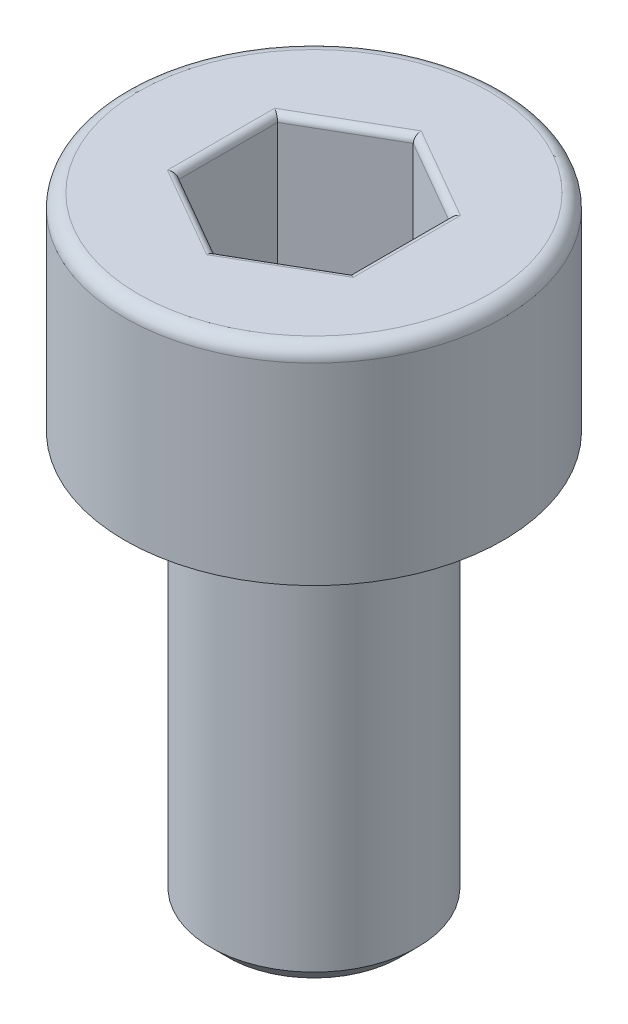
ISO-10303-21;
HEADER;
FILE_DESCRIPTION(('STEP AP214'),'2;1');
FILE_NAME('part.step','',(''),(''),'','','');
FILE_SCHEMA(('AUTOMOTIVE_DESIGN { 1 0 10303 214 1 1 1 1 }'));
ENDSEC;
DATA;
#1=APPLICATION_CONTEXT('core data for automotive mechanical design processes');
#2=APPLICATION_PROTOCOL_DEFINITION('international standard','automotive_design',2000,#1);
#3=PRODUCT_CONTEXT('',#1,'mechanical');
#4=PRODUCT('Part','Part','',(#3));
#5=PRODUCT_RELATED_PRODUCT_CATEGORY('part','',(#4));
#6=PRODUCT_DEFINITION_FORMATION('','',#4);
#7=PRODUCT_DEFINITION_CONTEXT('part definition',#1,'design');
#8=PRODUCT_DEFINITION('design','',#6,#7);
#9=PRODUCT_DEFINITION_SHAPE('','',#8);
#10=(LENGTH_UNIT() NAMED_UNIT(*) SI_UNIT(.MILLI.,.METRE.));
#11=(NAMED_UNIT(*) PLANE_ANGLE_UNIT() SI_UNIT($,.RADIAN.));
#12=(NAMED_UNIT(*) SI_UNIT($,.STERADIAN.) SOLID_ANGLE_UNIT());
#13=UNCERTAINTY_MEASURE_WITH_UNIT(LENGTH_MEASURE(1.E-05),#10,'distance_accuracy_value','');
#14=(GEOMETRIC_REPRESENTATION_CONTEXT(3) GLOBAL_UNCERTAINTY_ASSIGNED_CONTEXT((#13)) GLOBAL_UNIT_ASSIGNED_CONTEXT((#10,
#11,#12)) REPRESENTATION_CONTEXT('',''));
#15=CARTESIAN_POINT('',(0.,0.,0.));
#16=DIRECTION('',(0.,0.,1.));
#17=DIRECTION('',(1.,0.,0.));
#18=AXIS2_PLACEMENT_3D('',#15,#16,#17);
#19=CARTESIAN_POINT('',(0.,-9.,0.));
#20=DIRECTION('',(0.,-1.,0.));
#21=DIRECTION('',(0.,0.,-1.));
#22=AXIS2_PLACEMENT_3D('',#19,#20,#21);
#23=PLANE('',#22);
#24=CARTESIAN_POINT('',(0.,-9.,0.));
#25=DIRECTION('',(0.,-1.,0.));
#26=DIRECTION('',(0.,0.,-1.));
#27=AXIS2_PLACEMENT_3D('',#24,#25,#26);
#28=CIRCLE('',#27,1.25);
#29=CARTESIAN_POINT('',(0.,-9.,-1.25));
#30=VERTEX_POINT('',#29);
#31=EDGE_CURVE('E261',#30,#30,#28,.T.);
#32=ORIENTED_EDGE('',*,*,#31,.T.);
#33=EDGE_LOOP('',(#32));
#34=FACE_BOUND('',#33,.T.);
#35=ADVANCED_FACE('F33',(#34),#23,.T.);
#36=CARTESIAN_POINT('',(0.,0.,0.));
#37=DIRECTION('',(0.,1.,0.));
#38=DIRECTION('',(0.,0.,1.));
#39=AXIS2_PLACEMENT_3D('',#36,#37,#38);
#40=CYLINDRICAL_SURFACE('',#39,1.5);
#41=CARTESIAN_POINT('',(0.,-3.25,0.));
#42=DIRECTION('',(0.,-1.,0.));
#43=DIRECTION('',(0.,0.,-1.));
#44=AXIS2_PLACEMENT_3D('',#41,#42,#43);
#45=CIRCLE('',#44,1.5);
#46=CARTESIAN_POINT('',(0.,-3.25,-1.5));
#47=VERTEX_POINT('',#46);
#48=EDGE_CURVE('E258',#47,#47,#45,.T.);
#49=ORIENTED_EDGE('',*,*,#48,.T.);
#50=EDGE_LOOP('',(#49));
#51=FACE_BOUND('',#50,.T.);
#52=CARTESIAN_POINT('',(0.,-8.75,0.));
#53=DIRECTION('',(0.,-1.,0.));
#54=DIRECTION('',(0.,0.,-1.));
#55=AXIS2_PLACEMENT_3D('',#52,#53,#54);
#56=CIRCLE('',#55,1.5);
#57=CARTESIAN_POINT('',(0.,-8.75,-1.5));
#58=VERTEX_POINT('',#57);
#59=EDGE_CURVE('E255',#58,#58,#56,.F.);
#60=ORIENTED_EDGE('',*,*,#59,.T.);
#61=EDGE_LOOP('',(#60));
#62=FACE_BOUND('',#61,.T.);
#63=ADVANCED_FACE('F287',(#51,#62),#40,.T.);
#64=CARTESIAN_POINT('',(-1.5,-3.,0.));
#65=DIRECTION('',(0.,-1.,0.));
#66=DIRECTION('',(0.,0.,-1.));
#67=AXIS2_PLACEMENT_3D('',#64,#65,#66);
#68=PLANE('',#67);
#69=CARTESIAN_POINT('',(0.,-3.,0.));
#70=DIRECTION('',(0.,-1.,0.));
#71=DIRECTION('',(0.,0.,-1.));
#72=AXIS2_PLACEMENT_3D('',#69,#70,#71);
#73=CIRCLE('',#72,1.75);
#74=CARTESIAN_POINT('',(0.,-3.,-1.75));
#75=VERTEX_POINT('',#74);
#76=EDGE_CURVE('E252',#75,#75,#73,.F.);
#77=ORIENTED_EDGE('',*,*,#76,.T.);
#78=EDGE_LOOP('',(#77));
#79=FACE_BOUND('',#78,.T.);
#80=CARTESIAN_POINT('',(0.,-3.,0.));
#81=DIRECTION('',(0.,1.,0.));
#82=DIRECTION('',(0.,0.,1.));
#83=AXIS2_PLACEMENT_3D('',#80,#81,#82);
#84=CIRCLE('',#83,2.75);
#85=CARTESIAN_POINT('',(0.,-3.,2.75));
#86=VERTEX_POINT('',#85);
#87=EDGE_CURVE('E249',#86,#86,#84,.T.);
#88=ORIENTED_EDGE('',*,*,#87,.F.);
#89=EDGE_LOOP('',(#88));
#90=FACE_BOUND('',#89,.T.);
#91=ADVANCED_FACE('F293',(#79,#90),#68,.T.);
#92=CARTESIAN_POINT('',(0.,0.,0.));
#93=DIRECTION('',(0.,1.,0.));
#94=DIRECTION('',(0.,0.,1.));
#95=AXIS2_PLACEMENT_3D('',#92,#93,#94);
#96=CYLINDRICAL_SURFACE('',#95,2.75);
#97=CARTESIAN_POINT('',(0.,-0.2,0.));
#98=DIRECTION('',(0.,1.,0.));
#99=DIRECTION('',(0.,0.,1.));
#100=AXIS2_PLACEMENT_3D('',#97,#98,#99);
#101=CIRCLE('',#100,2.75);
#102=CARTESIAN_POINT('',(0.,-0.2,2.75));
#103=VERTEX_POINT('',#102);
#104=EDGE_CURVE('E159',#103,#103,#101,.F.);
#105=ORIENTED_EDGE('',*,*,#104,.T.);
#106=EDGE_LOOP('',(#105));
#107=FACE_BOUND('',#106,.T.);
#108=ORIENTED_EDGE('',*,*,#87,.T.);
#109=EDGE_LOOP('',(#108));
#110=FACE_BOUND('',#109,.T.);
#111=ADVANCED_FACE('F303',(#107,#110),#96,.T.);
#112=CARTESIAN_POINT('',(-2.75,0.,0.));
#113=DIRECTION('',(0.,1.,0.));
#114=DIRECTION('',(0.,0.,1.));
#115=AXIS2_PLACEMENT_3D('',#112,#113,#114);
#116=PLANE('',#115);
#117=DIRECTION('',(0.,0.,1.));
#118=VECTOR('',#117,1.);
#119=CARTESIAN_POINT('',(-1.35,0.,-0.721687836487033));
#120=LINE('',#119,#118);
#121=CARTESIAN_POINT('',(-1.35,0.,0.779422863405995));
#122=VERTEX_POINT('',#121);
#123=CARTESIAN_POINT('',(-1.35,0.,-0.779422863405995));
#124=VERTEX_POINT('',#123);
#125=EDGE_CURVE('E175',#122,#124,#120,.F.);
#126=ORIENTED_EDGE('',*,*,#125,.T.);
#127=DIRECTION('',(-0.866025403784439,0.,0.5));
#128=VECTOR('',#127,1.);
#129=CARTESIAN_POINT('',(-0.0500000000000002,0.,-1.52997821335251));
#130=LINE('',#129,#128);
#131=CARTESIAN_POINT('',(0.,0.,-1.55884572681199));
#132=VERTEX_POINT('',#131);
#133=EDGE_CURVE('E134',#124,#132,#130,.F.);
#134=ORIENTED_EDGE('',*,*,#133,.T.);
#135=DIRECTION('',(-0.866025403784439,0.,-0.5));
#136=VECTOR('',#135,1.);
#137=CARTESIAN_POINT('',(1.3,0.,-0.808290376865477));
#138=LINE('',#137,#136);
#139=CARTESIAN_POINT('',(1.35,0.,-0.779422863405995));
#140=VERTEX_POINT('',#139);
#141=EDGE_CURVE('E161',#132,#140,#138,.F.);
#142=ORIENTED_EDGE('',*,*,#141,.T.);
#143=DIRECTION('',(0.,0.,-1.));
#144=VECTOR('',#143,1.);
#145=CARTESIAN_POINT('',(1.35,0.,0.721687836487034));
#146=LINE('',#145,#144);
#147=CARTESIAN_POINT('',(1.35,0.,0.779422863405996));
#148=VERTEX_POINT('',#147);
#149=EDGE_CURVE('E169',#140,#148,#146,.F.);
#150=ORIENTED_EDGE('',*,*,#149,.T.);
#151=DIRECTION('',(0.866025403784439,0.,-0.5));
#152=VECTOR('',#151,1.);
#153=CARTESIAN_POINT('',(0.05,0.,1.52997821335251));
#154=LINE('',#153,#152);
#155=CARTESIAN_POINT('',(0.,0.,1.55884572681199));
#156=VERTEX_POINT('',#155);
#157=EDGE_CURVE('E171',#148,#156,#154,.F.);
#158=ORIENTED_EDGE('',*,*,#157,.T.);
#159=DIRECTION('',(0.866025403784438,0.,0.5));
#160=VECTOR('',#159,1.);
#161=CARTESIAN_POINT('',(-1.3,0.,0.808290376865476));
#162=LINE('',#161,#160);
#163=EDGE_CURVE('E173',#156,#122,#162,.F.);
#164=ORIENTED_EDGE('',*,*,#163,.T.);
#165=EDGE_LOOP('',(#126,#134,#142,#150,#158,#164));
#166=FACE_BOUND('',#165,.T.);
#167=CARTESIAN_POINT('',(0.,0.,0.));
#168=DIRECTION('',(0.,1.,0.));
#169=DIRECTION('',(0.,0.,1.));
#170=AXIS2_PLACEMENT_3D('',#167,#168,#169);
#171=CIRCLE('',#170,2.55);
#172=CARTESIAN_POINT('',(0.,0.,2.55));
#173=VERTEX_POINT('',#172);
#174=EDGE_CURVE('E164',#173,#173,#171,.T.);
#175=ORIENTED_EDGE('',*,*,#174,.T.);
#176=EDGE_LOOP('',(#175));
#177=FACE_BOUND('',#176,.T.);
#178=ADVANCED_FACE('F266',(#166,#177),#116,.T.);
#179=CARTESIAN_POINT('',(0.,-3.,0.));
#180=DIRECTION('',(0.,1.,0.));
#181=DIRECTION('',(0.,0.,1.));
#182=AXIS2_PLACEMENT_3D('',#179,#180,#181);
#183=CONICAL_SURFACE('',#182,1.75,0.785398163397453);
#184=ORIENTED_EDGE('',*,*,#48,.F.);
#185=EDGE_LOOP('',(#184));
#186=FACE_BOUND('',#185,.T.);
#187=ORIENTED_EDGE('',*,*,#76,.F.);
#188=EDGE_LOOP('',(#187));
#189=FACE_BOUND('',#188,.T.);
#190=ADVANCED_FACE('F281',(#186,#189),#183,.T.);
#191=CARTESIAN_POINT('',(0.,-8.75,0.));
#192=DIRECTION('',(0.,1.,0.));
#193=DIRECTION('',(0.,0.,1.));
#194=AXIS2_PLACEMENT_3D('',#191,#192,#193);
#195=CONICAL_SURFACE('',#194,1.5,0.785398163397454);
#196=ORIENTED_EDGE('',*,*,#31,.F.);
#197=EDGE_LOOP('',(#196));
#198=FACE_BOUND('',#197,.T.);
#199=ORIENTED_EDGE('',*,*,#59,.F.);
#200=EDGE_LOOP('',(#199));
#201=FACE_BOUND('',#200,.T.);
#202=ADVANCED_FACE('F271',(#198,#201),#195,.T.);
#203=CARTESIAN_POINT('',(0.,-0.2,0.));
#204=DIRECTION('',(0.,1.,0.));
#205=DIRECTION('',(0.,0.,1.));
#206=AXIS2_PLACEMENT_3D('',#203,#204,#205);
#207=TOROIDAL_SURFACE('',#206,2.55,0.2);
#208=ORIENTED_EDGE('',*,*,#104,.F.);
#209=EDGE_LOOP('',(#208));
#210=FACE_BOUND('',#209,.T.);
#211=ORIENTED_EDGE('',*,*,#174,.F.);
#212=EDGE_LOOP('',(#211));
#213=FACE_BOUND('',#212,.T.);
#214=ADVANCED_FACE('F268',(#210,#213),#207,.T.);
#215=CARTESIAN_POINT('',(1.25,-2.,-0.721687836487033));
#216=DIRECTION('',(0.5,0.,-0.866025403784439));
#217=DIRECTION('',(-0.866025403784439,0.,-0.5));
#218=AXIS2_PLACEMENT_3D('',#215,#216,#217);
#219=PLANE('',#218);
#220=DIRECTION('',(0.,1.,0.));
#221=VECTOR('',#220,1.);
#222=CARTESIAN_POINT('',(1.25,-2.,-0.721687836487033));
#223=LINE('',#222,#221);
#224=CARTESIAN_POINT('',(1.25,-1.9,-0.721687836487033));
#225=VERTEX_POINT('',#224);
#226=CARTESIAN_POINT('',(1.25,-0.1,-0.721687836487033));
#227=VERTEX_POINT('',#226);
#228=EDGE_CURVE('E243',#225,#227,#223,.T.);
#229=ORIENTED_EDGE('',*,*,#228,.T.);
#230=DIRECTION('',(-0.866025403784439,0.,-0.5));
#231=VECTOR('',#230,1.);
#232=CARTESIAN_POINT('',(0.,-0.1,-1.44337567297406));
#233=LINE('',#232,#231);
#234=CARTESIAN_POINT('',(0.,-0.1,-1.44337567297406));
#235=VERTEX_POINT('',#234);
#236=EDGE_CURVE('E195',#227,#235,#233,.T.);
#237=ORIENTED_EDGE('',*,*,#236,.T.);
#238=DIRECTION('',(0.,1.,0.));
#239=VECTOR('',#238,1.);
#240=CARTESIAN_POINT('',(0.,-2.,-1.44337567297406));
#241=LINE('',#240,#239);
#242=CARTESIAN_POINT('',(0.,-1.9,-1.44337567297406));
#243=VERTEX_POINT('',#242);
#244=EDGE_CURVE('E145',#243,#235,#241,.T.);
#245=ORIENTED_EDGE('',*,*,#244,.F.);
#246=DIRECTION('',(-0.866025403784439,0.,-0.5));
#247=VECTOR('',#246,1.);
#248=CARTESIAN_POINT('',(1.25,-1.9,-0.721687836487033));
#249=LINE('',#248,#247);
#250=EDGE_CURVE('E193',#243,#225,#249,.F.);
#251=ORIENTED_EDGE('',*,*,#250,.T.);
#252=EDGE_LOOP('',(#229,#237,#245,#251));
#253=FACE_BOUND('',#252,.T.);
#254=ADVANCED_FACE('F270',(#253),#219,.F.);
#255=CARTESIAN_POINT('',(1.25,-2.,0.721687836487034));
#256=DIRECTION('',(1.,0.,0.));
#257=DIRECTION('',(0.,0.,-1.));
#258=AXIS2_PLACEMENT_3D('',#255,#256,#257);
#259=PLANE('',#258);
#260=DIRECTION('',(0.,1.,0.));
#261=VECTOR('',#260,1.);
#262=CARTESIAN_POINT('',(1.25,-2.,0.721687836487034));
#263=LINE('',#262,#261);
#264=CARTESIAN_POINT('',(1.25,-1.9,0.721687836487034));
#265=VERTEX_POINT('',#264);
#266=CARTESIAN_POINT('',(1.25,-0.1,0.721687836487034));
#267=VERTEX_POINT('',#266);
#268=EDGE_CURVE('E240',#265,#267,#263,.T.);
#269=ORIENTED_EDGE('',*,*,#268,.T.);
#270=DIRECTION('',(0.,0.,-1.));
#271=VECTOR('',#270,1.);
#272=CARTESIAN_POINT('',(1.25,-0.1,-0.721687836487033));
#273=LINE('',#272,#271);
#274=EDGE_CURVE('E191',#267,#227,#273,.T.);
#275=ORIENTED_EDGE('',*,*,#274,.T.);
#276=ORIENTED_EDGE('',*,*,#228,.F.);
#277=DIRECTION('',(0.,0.,-1.));
#278=VECTOR('',#277,1.);
#279=CARTESIAN_POINT('',(1.25,-1.9,0.721687836487034));
#280=LINE('',#279,#278);
#281=EDGE_CURVE('E188',#225,#265,#280,.F.);
#282=ORIENTED_EDGE('',*,*,#281,.T.);
#283=EDGE_LOOP('',(#269,#275,#276,#282));
#284=FACE_BOUND('',#283,.T.);
#285=ADVANCED_FACE('F278',(#284),#259,.F.);
#286=CARTESIAN_POINT('',(0.,-2.,1.44337567297407));
#287=DIRECTION('',(0.5,0.,0.866025403784439));
#288=DIRECTION('',(0.866025403784439,0.,-0.5));
#289=AXIS2_PLACEMENT_3D('',#286,#287,#288);
#290=PLANE('',#289);
#291=DIRECTION('',(0.,1.,0.));
#292=VECTOR('',#291,1.);
#293=CARTESIAN_POINT('',(0.,-2.,1.44337567297407));
#294=LINE('',#293,#292);
#295=CARTESIAN_POINT('',(0.,-1.9,1.44337567297407));
#296=VERTEX_POINT('',#295);
#297=CARTESIAN_POINT('',(0.,-0.1,1.44337567297407));
#298=VERTEX_POINT('',#297);
#299=EDGE_CURVE('E237',#296,#298,#294,.T.);
#300=ORIENTED_EDGE('',*,*,#299,.T.);
#301=DIRECTION('',(0.866025403784439,0.,-0.5));
#302=VECTOR('',#301,1.);
#303=CARTESIAN_POINT('',(1.25,-0.1,0.721687836487034));
#304=LINE('',#303,#302);
#305=EDGE_CURVE('E186',#298,#267,#304,.T.);
#306=ORIENTED_EDGE('',*,*,#305,.T.);
#307=ORIENTED_EDGE('',*,*,#268,.F.);
#308=DIRECTION('',(0.866025403784439,0.,-0.5));
#309=VECTOR('',#308,1.);
#310=CARTESIAN_POINT('',(0.,-1.9,1.44337567297407));
#311=LINE('',#310,#309);
#312=EDGE_CURVE('E184',#265,#296,#311,.F.);
#313=ORIENTED_EDGE('',*,*,#312,.T.);
#314=EDGE_LOOP('',(#300,#306,#307,#313));
#315=FACE_BOUND('',#314,.T.);
#316=ADVANCED_FACE('F327',(#315),#290,.F.);
#317=CARTESIAN_POINT('',(-1.25,-2.,0.721687836487033));
#318=DIRECTION('',(-0.5,0.,0.866025403784439));
#319=DIRECTION('',(0.866025403784438,0.,0.5));
#320=AXIS2_PLACEMENT_3D('',#317,#318,#319);
#321=PLANE('',#320);
#322=DIRECTION('',(0.,1.,0.));
#323=VECTOR('',#322,1.);
#324=CARTESIAN_POINT('',(-1.25,-2.,0.721687836487033));
#325=LINE('',#324,#323);
#326=CARTESIAN_POINT('',(-1.25,-1.9,0.721687836487033));
#327=VERTEX_POINT('',#326);
#328=CARTESIAN_POINT('',(-1.25,-0.1,0.721687836487033));
#329=VERTEX_POINT('',#328);
#330=EDGE_CURVE('E128',#327,#329,#325,.T.);
#331=ORIENTED_EDGE('',*,*,#330,.T.);
#332=DIRECTION('',(0.866025403784438,0.,0.5));
#333=VECTOR('',#332,1.);
#334=CARTESIAN_POINT('',(0.,-0.1,1.44337567297407));
#335=LINE('',#334,#333);
#336=EDGE_CURVE('E182',#329,#298,#335,.T.);
#337=ORIENTED_EDGE('',*,*,#336,.T.);
#338=ORIENTED_EDGE('',*,*,#299,.F.);
#339=DIRECTION('',(0.866025403784438,0.,0.5));
#340=VECTOR('',#339,1.);
#341=CARTESIAN_POINT('',(-1.25,-1.9,0.721687836487033));
#342=LINE('',#341,#340);
#343=EDGE_CURVE('E180',#296,#327,#342,.F.);
#344=ORIENTED_EDGE('',*,*,#343,.T.);
#345=EDGE_LOOP('',(#331,#337,#338,#344));
#346=FACE_BOUND('',#345,.T.);
#347=ADVANCED_FACE('F234',(#346),#321,.F.);
#348=CARTESIAN_POINT('',(-1.25,-2.,-0.721687836487033));
#349=DIRECTION('',(-1.,0.,0.));
#350=DIRECTION('',(0.,0.,1.));
#351=AXIS2_PLACEMENT_3D('',#348,#349,#350);
#352=PLANE('',#351);
#353=DIRECTION('',(0.,1.,0.));
#354=VECTOR('',#353,1.);
#355=CARTESIAN_POINT('',(-1.25,-2.,-0.721687836487033));
#356=LINE('',#355,#354);
#357=CARTESIAN_POINT('',(-1.25,-1.9,-0.721687836487033));
#358=VERTEX_POINT('',#357);
#359=CARTESIAN_POINT('',(-1.25,-0.1,-0.721687836487033));
#360=VERTEX_POINT('',#359);
#361=EDGE_CURVE('E126',#358,#360,#356,.T.);
#362=ORIENTED_EDGE('',*,*,#361,.T.);
#363=DIRECTION('',(0.,0.,1.));
#364=VECTOR('',#363,1.);
#365=CARTESIAN_POINT('',(-1.25,-0.1,0.721687836487033));
#366=LINE('',#365,#364);
#367=EDGE_CURVE('E133',#360,#329,#366,.T.);
#368=ORIENTED_EDGE('',*,*,#367,.T.);
#369=ORIENTED_EDGE('',*,*,#330,.F.);
#370=DIRECTION('',(0.,0.,1.));
#371=VECTOR('',#370,1.);
#372=CARTESIAN_POINT('',(-1.25,-1.9,-0.721687836487033));
#373=LINE('',#372,#371);
#374=EDGE_CURVE('E123',#327,#358,#373,.F.);
#375=ORIENTED_EDGE('',*,*,#374,.T.);
#376=EDGE_LOOP('',(#362,#368,#369,#375));
#377=FACE_BOUND('',#376,.T.);
#378=ADVANCED_FACE('F125',(#377),#352,.F.);
#379=CARTESIAN_POINT('',(0.,-2.,-1.44337567297406));
#380=DIRECTION('',(-0.5,0.,-0.866025403784439));
#381=DIRECTION('',(-0.866025403784439,0.,0.5));
#382=AXIS2_PLACEMENT_3D('',#379,#380,#381);
#383=PLANE('',#382);
#384=ORIENTED_EDGE('',*,*,#244,.T.);
#385=DIRECTION('',(-0.866025403784439,0.,0.5));
#386=VECTOR('',#385,1.);
#387=CARTESIAN_POINT('',(-1.25,-0.1,-0.721687836487032));
#388=LINE('',#387,#386);
#389=EDGE_CURVE('E144',#235,#360,#388,.T.);
#390=ORIENTED_EDGE('',*,*,#389,.T.);
#391=ORIENTED_EDGE('',*,*,#361,.F.);
#392=DIRECTION('',(-0.866025403784439,0.,0.5));
#393=VECTOR('',#392,1.);
#394=CARTESIAN_POINT('',(0.,-1.9,-1.44337567297406));
#395=LINE('',#394,#393);
#396=EDGE_CURVE('E141',#358,#243,#395,.F.);
#397=ORIENTED_EDGE('',*,*,#396,.T.);
#398=EDGE_LOOP('',(#384,#390,#391,#397));
#399=FACE_BOUND('',#398,.T.);
#400=ADVANCED_FACE('F139',(#399),#383,.F.);
#401=CARTESIAN_POINT('',(1.25,-2.,-0.721687836487033));
#402=DIRECTION('',(0.,-1.,0.));
#403=DIRECTION('',(0.,0.,-1.));
#404=AXIS2_PLACEMENT_3D('',#401,#402,#403);
#405=PLANE('',#404);
#406=DIRECTION('',(0.866025403784439,0.,-0.5));
#407=VECTOR('',#406,1.);
#408=CARTESIAN_POINT('',(1.2,-2.,0.63508529610859));
#409=LINE('',#408,#407);
#410=CARTESIAN_POINT('',(0.,-2.,1.32790561913614));
#411=VERTEX_POINT('',#410);
#412=CARTESIAN_POINT('',(1.15,-2.,0.663952809568071));
#413=VERTEX_POINT('',#412);
#414=EDGE_CURVE('E42',#411,#413,#409,.T.);
#415=ORIENTED_EDGE('',*,*,#414,.T.);
#416=DIRECTION('',(0.,0.,-1.));
#417=VECTOR('',#416,1.);
#418=CARTESIAN_POINT('',(1.15,-2.,-0.721687836487033));
#419=LINE('',#418,#417);
#420=CARTESIAN_POINT('',(1.15,-2.,-0.66395280956807));
#421=VERTEX_POINT('',#420);
#422=EDGE_CURVE('E11',#413,#421,#419,.T.);
#423=ORIENTED_EDGE('',*,*,#422,.T.);
#424=DIRECTION('',(-0.866025403784439,0.,-0.5));
#425=VECTOR('',#424,1.);
#426=CARTESIAN_POINT('',(-0.0500000000000001,-2.,-1.35677313259562));
#427=LINE('',#426,#425);
#428=CARTESIAN_POINT('',(0.,-2.,-1.32790561913614));
#429=VERTEX_POINT('',#428);
#430=EDGE_CURVE('E197',#421,#429,#427,.T.);
#431=ORIENTED_EDGE('',*,*,#430,.T.);
#432=DIRECTION('',(-0.866025403784439,0.,0.5));
#433=VECTOR('',#432,1.);
#434=CARTESIAN_POINT('',(-1.2,-2.,-0.635085296108588));
#435=LINE('',#434,#433);
#436=CARTESIAN_POINT('',(-1.15,-2.,-0.66395280956807));
#437=VERTEX_POINT('',#436);
#438=EDGE_CURVE('E199',#429,#437,#435,.T.);
#439=ORIENTED_EDGE('',*,*,#438,.T.);
#440=DIRECTION('',(0.,0.,1.));
#441=VECTOR('',#440,1.);
#442=CARTESIAN_POINT('',(-1.15,-2.,0.721687836487033));
#443=LINE('',#442,#441);
#444=CARTESIAN_POINT('',(-1.15,-2.,0.66395280956807));
#445=VERTEX_POINT('',#444);
#446=EDGE_CURVE('E150',#437,#445,#443,.T.);
#447=ORIENTED_EDGE('',*,*,#446,.T.);
#448=DIRECTION('',(0.866025403784438,0.,0.5));
#449=VECTOR('',#448,1.);
#450=CARTESIAN_POINT('',(0.0499999999999999,-2.,1.35677313259562));
#451=LINE('',#450,#449);
#452=EDGE_CURVE('E53',#445,#411,#451,.T.);
#453=ORIENTED_EDGE('',*,*,#452,.T.);
#454=EDGE_LOOP('',(#415,#423,#431,#439,#447,#453));
#455=FACE_BOUND('',#454,.T.);
#456=ADVANCED_FACE('F322',(#455),#405,.F.);
#457=CARTESIAN_POINT('',(0.05,-0.1,1.52997821335251));
#458=DIRECTION('',(-0.866025403784439,0.,0.5));
#459=DIRECTION('',(0.5,0.,0.866025403784439));
#460=AXIS2_PLACEMENT_3D('',#457,#458,#459);
#461=CYLINDRICAL_SURFACE('',#460,0.1);
#462=CARTESIAN_POINT('',(0.,-0.1,1.55884572681199));
#463=DIRECTION('',(-1.,0.,0.));
#464=DIRECTION('',(0.,0.,-1.));
#465=AXIS2_PLACEMENT_3D('',#462,#463,#464);
#466=ELLIPSE('',#465,0.115470053837925,0.1);
#467=EDGE_CURVE('E214',#156,#298,#466,.T.);
#468=ORIENTED_EDGE('',*,*,#467,.F.);
#469=ORIENTED_EDGE('',*,*,#157,.F.);
#470=CARTESIAN_POINT('',(1.35,-0.1,0.779422863405997));
#471=DIRECTION('',(-0.5,0.,0.866025403784438));
#472=DIRECTION('',(-0.866025403784438,0.,-0.5));
#473=AXIS2_PLACEMENT_3D('',#470,#471,#472);
#474=ELLIPSE('',#473,0.115470053837925,0.1);
#475=EDGE_CURVE('E217',#267,#148,#474,.F.);
#476=ORIENTED_EDGE('',*,*,#475,.F.);
#477=ORIENTED_EDGE('',*,*,#305,.F.);
#478=EDGE_LOOP('',(#468,#469,#476,#477));
#479=FACE_BOUND('',#478,.T.);
#480=ADVANCED_FACE('F334',(#479),#461,.T.);
#481=CARTESIAN_POINT('',(1.35,-0.1,0.721687836487034));
#482=DIRECTION('',(0.,0.,1.));
#483=DIRECTION('',(1.,0.,0.));
#484=AXIS2_PLACEMENT_3D('',#481,#482,#483);
#485=CYLINDRICAL_SURFACE('',#484,0.1);
#486=ORIENTED_EDGE('',*,*,#475,.T.);
#487=ORIENTED_EDGE('',*,*,#149,.F.);
#488=CARTESIAN_POINT('',(1.35,-0.1,-0.779422863405995));
#489=DIRECTION('',(0.5,0.,0.866025403784439));
#490=DIRECTION('',(-0.866025403784439,0.,0.5));
#491=AXIS2_PLACEMENT_3D('',#488,#489,#490);
#492=ELLIPSE('',#491,0.115470053837925,0.1);
#493=EDGE_CURVE('E211',#227,#140,#492,.F.);
#494=ORIENTED_EDGE('',*,*,#493,.F.);
#495=ORIENTED_EDGE('',*,*,#274,.F.);
#496=EDGE_LOOP('',(#486,#487,#494,#495));
#497=FACE_BOUND('',#496,.T.);
#498=ADVANCED_FACE('F338',(#497),#485,.T.);
#499=CARTESIAN_POINT('',(-1.3,-0.1,0.808290376865476));
#500=DIRECTION('',(-0.866025403784438,0.,-0.5));
#501=DIRECTION('',(-0.5,0.,0.866025403784439));
#502=AXIS2_PLACEMENT_3D('',#499,#500,#501);
#503=CYLINDRICAL_SURFACE('',#502,0.1);
#504=ORIENTED_EDGE('',*,*,#467,.T.);
#505=ORIENTED_EDGE('',*,*,#336,.F.);
#506=CARTESIAN_POINT('',(-1.35,-0.1,0.779422863405995));
#507=DIRECTION('',(-0.5,0.,-0.866025403784439));
#508=DIRECTION('',(0.866025403784439,0.,-0.5));
#509=AXIS2_PLACEMENT_3D('',#506,#507,#508);
#510=ELLIPSE('',#509,0.115470053837925,0.1);
#511=EDGE_CURVE('E208',#122,#329,#510,.T.);
#512=ORIENTED_EDGE('',*,*,#511,.F.);
#513=ORIENTED_EDGE('',*,*,#163,.F.);
#514=EDGE_LOOP('',(#504,#505,#512,#513));
#515=FACE_BOUND('',#514,.T.);
#516=ADVANCED_FACE('F344',(#515),#503,.T.);
#517=CARTESIAN_POINT('',(1.3,-0.1,-0.808290376865477));
#518=DIRECTION('',(0.866025403784439,0.,0.5));
#519=DIRECTION('',(0.5,0.,-0.866025403784439));
#520=AXIS2_PLACEMENT_3D('',#517,#518,#519);
#521=CYLINDRICAL_SURFACE('',#520,0.1);
#522=ORIENTED_EDGE('',*,*,#493,.T.);
#523=ORIENTED_EDGE('',*,*,#141,.F.);
#524=CARTESIAN_POINT('',(0.,-0.1,-1.55884572681199));
#525=DIRECTION('',(1.,0.,0.));
#526=DIRECTION('',(0.,0.,-1.));
#527=AXIS2_PLACEMENT_3D('',#524,#525,#526);
#528=ELLIPSE('',#527,0.115470053837925,0.1);
#529=EDGE_CURVE('E206',#235,#132,#528,.F.);
#530=ORIENTED_EDGE('',*,*,#529,.F.);
#531=ORIENTED_EDGE('',*,*,#236,.F.);
#532=EDGE_LOOP('',(#522,#523,#530,#531));
#533=FACE_BOUND('',#532,.T.);
#534=ADVANCED_FACE('F374',(#533),#521,.T.);
#535=CARTESIAN_POINT('',(-1.35,-0.1,-0.721687836487033));
#536=DIRECTION('',(0.,0.,-1.));
#537=DIRECTION('',(-1.,0.,0.));
#538=AXIS2_PLACEMENT_3D('',#535,#536,#537);
#539=CYLINDRICAL_SURFACE('',#538,0.1);
#540=ORIENTED_EDGE('',*,*,#511,.T.);
#541=ORIENTED_EDGE('',*,*,#367,.F.);
#542=CARTESIAN_POINT('',(-1.35,-0.1,-0.779422863405995));
#543=DIRECTION('',(0.5,0.,-0.866025403784439));
#544=DIRECTION('',(0.866025403784439,0.,0.5));
#545=AXIS2_PLACEMENT_3D('',#542,#543,#544);
#546=ELLIPSE('',#545,0.115470053837925,0.1);
#547=EDGE_CURVE('E204',#124,#360,#546,.T.);
#548=ORIENTED_EDGE('',*,*,#547,.F.);
#549=ORIENTED_EDGE('',*,*,#125,.F.);
#550=EDGE_LOOP('',(#540,#541,#548,#549));
#551=FACE_BOUND('',#550,.T.);
#552=ADVANCED_FACE('F369',(#551),#539,.T.);
#553=CARTESIAN_POINT('',(-0.05,-0.1,-1.52997821335251));
#554=DIRECTION('',(0.866025403784439,0.,-0.5));
#555=DIRECTION('',(-0.5,0.,-0.866025403784439));
#556=AXIS2_PLACEMENT_3D('',#553,#554,#555);
#557=CYLINDRICAL_SURFACE('',#556,0.1);
#558=ORIENTED_EDGE('',*,*,#529,.T.);
#559=ORIENTED_EDGE('',*,*,#133,.F.);
#560=ORIENTED_EDGE('',*,*,#547,.T.);
#561=ORIENTED_EDGE('',*,*,#389,.F.);
#562=EDGE_LOOP('',(#558,#559,#560,#561));
#563=FACE_BOUND('',#562,.T.);
#564=ADVANCED_FACE('F365',(#563),#557,.T.);
#565=CARTESIAN_POINT('',(-1.15,-1.9,-0.721687836487033));
#566=DIRECTION('',(0.,0.,-1.));
#567=DIRECTION('',(-1.,0.,0.));
#568=AXIS2_PLACEMENT_3D('',#565,#566,#567);
#569=CYLINDRICAL_SURFACE('',#568,0.1);
#570=CARTESIAN_POINT('',(-1.15,-1.9,-0.663952809568069));
#571=DIRECTION('',(0.5,0.,-0.866025403784439));
#572=DIRECTION('',(-0.866025403784439,0.,-0.5));
#573=AXIS2_PLACEMENT_3D('',#570,#571,#572);
#574=ELLIPSE('',#573,0.115470053837925,0.1);
#575=EDGE_CURVE('E149',#358,#437,#574,.F.);
#576=ORIENTED_EDGE('',*,*,#575,.F.);
#577=ORIENTED_EDGE('',*,*,#374,.F.);
#578=CARTESIAN_POINT('',(-1.15,-1.9,0.66395280956807));
#579=DIRECTION('',(-0.5,0.,-0.866025403784439));
#580=DIRECTION('',(-0.866025403784439,0.,0.5));
#581=AXIS2_PLACEMENT_3D('',#578,#579,#580);
#582=ELLIPSE('',#581,0.115470053837925,0.1);
#583=EDGE_CURVE('E37',#445,#327,#582,.T.);
#584=ORIENTED_EDGE('',*,*,#583,.F.);
#585=ORIENTED_EDGE('',*,*,#446,.F.);
#586=EDGE_LOOP('',(#576,#577,#584,#585));
#587=FACE_BOUND('',#586,.T.);
#588=ADVANCED_FACE('F35',(#587),#569,.F.);
#589=CARTESIAN_POINT('',(0.0499999999999988,-1.9,1.35677313259562));
#590=DIRECTION('',(-0.866025403784438,0.,-0.5));
#591=DIRECTION('',(-0.5,0.,0.866025403784439));
#592=AXIS2_PLACEMENT_3D('',#589,#590,#591);
#593=CYLINDRICAL_SURFACE('',#592,0.1);
#594=ORIENTED_EDGE('',*,*,#583,.T.);
#595=ORIENTED_EDGE('',*,*,#343,.F.);
#596=CARTESIAN_POINT('',(0.,-1.9,1.32790561913614));
#597=DIRECTION('',(-1.,0.,0.));
#598=DIRECTION('',(0.,0.,1.));
#599=AXIS2_PLACEMENT_3D('',#596,#597,#598);
#600=ELLIPSE('',#599,0.115470053837925,0.1);
#601=EDGE_CURVE('E153',#411,#296,#600,.T.);
#602=ORIENTED_EDGE('',*,*,#601,.F.);
#603=ORIENTED_EDGE('',*,*,#452,.F.);
#604=EDGE_LOOP('',(#594,#595,#602,#603));
#605=FACE_BOUND('',#604,.T.);
#606=ADVANCED_FACE('F231',(#605),#593,.F.);
#607=CARTESIAN_POINT('',(0.675,-1.9,-1.71761705083914));
#608=DIRECTION('',(0.866025403784439,0.,-0.5));
#609=DIRECTION('',(-0.5,0.,-0.866025403784439));
#610=AXIS2_PLACEMENT_3D('',#607,#608,#609);
#611=CYLINDRICAL_SURFACE('',#610,0.1);
#612=ORIENTED_EDGE('',*,*,#575,.T.);
#613=ORIENTED_EDGE('',*,*,#438,.F.);
#614=CARTESIAN_POINT('',(0.,-1.9,-1.32790561913614));
#615=DIRECTION('',(1.,0.,0.));
#616=DIRECTION('',(0.,0.,-1.));
#617=AXIS2_PLACEMENT_3D('',#614,#615,#616);
#618=ELLIPSE('',#617,0.115470053837925,0.1);
#619=EDGE_CURVE('E157',#243,#429,#618,.F.);
#620=ORIENTED_EDGE('',*,*,#619,.F.);
#621=ORIENTED_EDGE('',*,*,#396,.F.);
#622=EDGE_LOOP('',(#612,#613,#620,#621));
#623=FACE_BOUND('',#622,.T.);
#624=ADVANCED_FACE('F155',(#623),#611,.F.);
#625=CARTESIAN_POINT('',(1.825,-1.9,0.274241377865074));
#626=DIRECTION('',(-0.866025403784439,0.,0.5));
#627=DIRECTION('',(0.5,0.,0.866025403784439));
#628=AXIS2_PLACEMENT_3D('',#625,#626,#627);
#629=CYLINDRICAL_SURFACE('',#628,0.1);
#630=ORIENTED_EDGE('',*,*,#601,.T.);
#631=ORIENTED_EDGE('',*,*,#312,.F.);
#632=CARTESIAN_POINT('',(1.15,-1.9,0.663952809568072));
#633=DIRECTION('',(-0.5,0.,0.866025403784438));
#634=DIRECTION('',(0.866025403784438,0.,0.5));
#635=AXIS2_PLACEMENT_3D('',#632,#633,#634);
#636=ELLIPSE('',#635,0.115470053837925,0.1);
#637=EDGE_CURVE('E222',#413,#265,#636,.T.);
#638=ORIENTED_EDGE('',*,*,#637,.F.);
#639=ORIENTED_EDGE('',*,*,#414,.F.);
#640=EDGE_LOOP('',(#630,#631,#638,#639));
#641=FACE_BOUND('',#640,.T.);
#642=ADVANCED_FACE('F228',(#641),#629,.F.);
#643=CARTESIAN_POINT('',(1.2,-1.9,-0.635085296108589));
#644=DIRECTION('',(0.866025403784439,0.,0.5));
#645=DIRECTION('',(0.5,0.,-0.866025403784439));
#646=AXIS2_PLACEMENT_3D('',#643,#644,#645);
#647=CYLINDRICAL_SURFACE('',#646,0.1);
#648=ORIENTED_EDGE('',*,*,#619,.T.);
#649=ORIENTED_EDGE('',*,*,#430,.F.);
#650=CARTESIAN_POINT('',(1.15,-1.9,-0.66395280956807));
#651=DIRECTION('',(0.5,0.,0.866025403784439));
#652=DIRECTION('',(-0.866025403784439,0.,0.5));
#653=AXIS2_PLACEMENT_3D('',#650,#651,#652);
#654=ELLIPSE('',#653,0.115470053837925,0.1);
#655=EDGE_CURVE('E220',#225,#421,#654,.F.);
#656=ORIENTED_EDGE('',*,*,#655,.F.);
#657=ORIENTED_EDGE('',*,*,#250,.F.);
#658=EDGE_LOOP('',(#648,#649,#656,#657));
#659=FACE_BOUND('',#658,.T.);
#660=ADVANCED_FACE('F353',(#659),#647,.F.);
#661=CARTESIAN_POINT('',(1.15,-1.9,-0.721687836487033));
#662=DIRECTION('',(0.,0.,1.));
#663=DIRECTION('',(1.,0.,0.));
#664=AXIS2_PLACEMENT_3D('',#661,#662,#663);
#665=CYLINDRICAL_SURFACE('',#664,0.1);
#666=ORIENTED_EDGE('',*,*,#637,.T.);
#667=ORIENTED_EDGE('',*,*,#281,.F.);
#668=ORIENTED_EDGE('',*,*,#655,.T.);
#669=ORIENTED_EDGE('',*,*,#422,.F.);
#670=EDGE_LOOP('',(#666,#667,#668,#669));
#671=FACE_BOUND('',#670,.T.);
#672=ADVANCED_FACE('F350',(#671),#665,.F.);
#673=CLOSED_SHELL('',(#35,#63,#91,#111,#178,#190,#202,#214,#254,#285,#316,#347,#378,#400,#456,
#480,#498,#516,#534,#552,#564,#588,#606,#624,#642,#660,#672));
#674=MANIFOLD_SOLID_BREP('B2',#673);
#675=ADVANCED_BREP_SHAPE_REPRESENTATION('',(#18,#674),#14);
#676=SHAPE_DEFINITION_REPRESENTATION(#9,#675);
ENDSEC;
END-ISO-10303-21;
